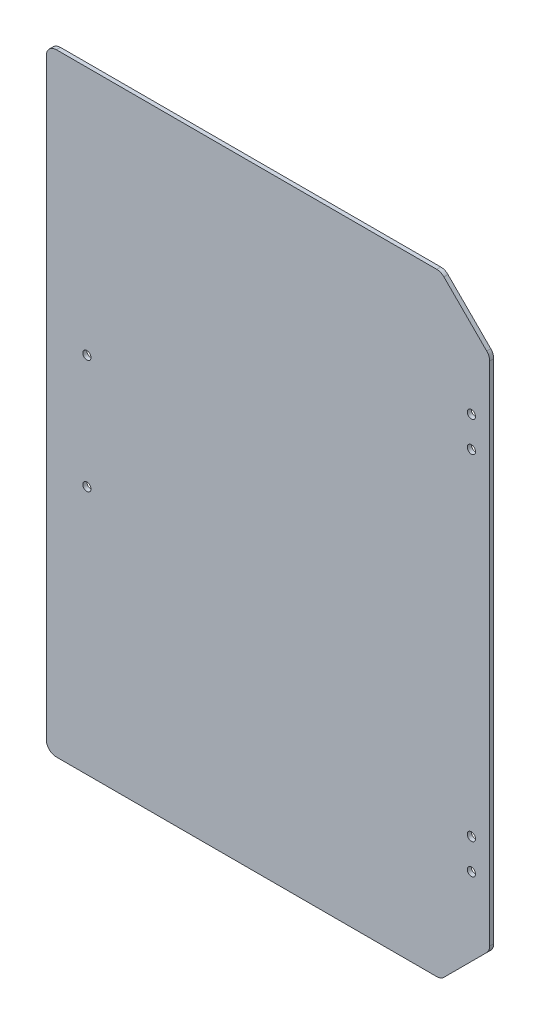
ISO-10303-21;
HEADER;
FILE_DESCRIPTION(('STEP AP214'),'2;1');
FILE_NAME('part.step','',(''),(''),'','','');
FILE_SCHEMA(('AUTOMOTIVE_DESIGN { 1 0 10303 214 1 1 1 1 }'));
ENDSEC;
DATA;
#1=APPLICATION_CONTEXT('core data for automotive mechanical design processes');
#2=APPLICATION_PROTOCOL_DEFINITION('international standard','automotive_design',2000,#1);
#3=PRODUCT_CONTEXT('',#1,'mechanical');
#4=PRODUCT('Part','Part','',(#3));
#5=PRODUCT_RELATED_PRODUCT_CATEGORY('part','',(#4));
#6=PRODUCT_DEFINITION_FORMATION('','',#4);
#7=PRODUCT_DEFINITION_CONTEXT('part definition',#1,'design');
#8=PRODUCT_DEFINITION('design','',#6,#7);
#9=PRODUCT_DEFINITION_SHAPE('','',#8);
#10=(LENGTH_UNIT() NAMED_UNIT(*) SI_UNIT(.MILLI.,.METRE.));
#11=(NAMED_UNIT(*) PLANE_ANGLE_UNIT() SI_UNIT($,.RADIAN.));
#12=(NAMED_UNIT(*) SI_UNIT($,.STERADIAN.) SOLID_ANGLE_UNIT());
#13=UNCERTAINTY_MEASURE_WITH_UNIT(LENGTH_MEASURE(1.E-05),#10,'distance_accuracy_value','');
#14=(GEOMETRIC_REPRESENTATION_CONTEXT(3) GLOBAL_UNCERTAINTY_ASSIGNED_CONTEXT((#13)) GLOBAL_UNIT_ASSIGNED_CONTEXT((#10,
#11,#12)) REPRESENTATION_CONTEXT('',''));
#15=CARTESIAN_POINT('',(0.,0.,0.));
#16=DIRECTION('',(0.,0.,1.));
#17=DIRECTION('',(1.,0.,0.));
#18=AXIS2_PLACEMENT_3D('',#15,#16,#17);
#19=CARTESIAN_POINT('',(0.,0.,4.));
#20=DIRECTION('',(0.,0.,-1.));
#21=DIRECTION('',(-1.,0.,0.));
#22=AXIS2_PLACEMENT_3D('',#19,#20,#21);
#23=PLANE('',#22);
#24=CARTESIAN_POINT('',(-198.144386368956,56.9354419410745,4.));
#25=DIRECTION('',(0.,0.,1.));
#26=DIRECTION('',(1.,0.,0.));
#27=AXIS2_PLACEMENT_3D('',#24,#25,#26);
#28=CIRCLE('',#27,4.04999999999999);
#29=CARTESIAN_POINT('',(-194.094386368956,56.9354419410745,4.));
#30=VERTEX_POINT('',#29);
#31=EDGE_CURVE('E263',#30,#30,#28,.T.);
#32=ORIENTED_EDGE('',*,*,#31,.F.);
#33=EDGE_LOOP('',(#32));
#34=FACE_BOUND('',#33,.T.);
#35=CARTESIAN_POINT('',(-198.144386368956,-55.0645580589255,4.));
#36=DIRECTION('',(0.,0.,1.));
#37=DIRECTION('',(1.,0.,0.));
#38=AXIS2_PLACEMENT_3D('',#35,#36,#37);
#39=CIRCLE('',#38,4.04999999999999);
#40=CARTESIAN_POINT('',(-194.094386368956,-55.0645580589255,4.));
#41=VERTEX_POINT('',#40);
#42=EDGE_CURVE('E257',#41,#41,#39,.T.);
#43=ORIENTED_EDGE('',*,*,#42,.F.);
#44=EDGE_LOOP('',(#43));
#45=FACE_BOUND('',#44,.T.);
#46=DIRECTION('',(-1.,0.,0.));
#47=VECTOR('',#46,1.);
#48=CARTESIAN_POINT('',(-238.144386368956,302.435441941074,4.));
#49=LINE('',#48,#47);
#50=CARTESIAN_POINT('',(146.213478007298,302.435441941074,4.));
#51=VERTEX_POINT('',#50);
#52=CARTESIAN_POINT('',(-228.144386368956,302.435441941074,4.));
#53=VERTEX_POINT('',#52);
#54=EDGE_CURVE('E160',#51,#53,#49,.T.);
#55=ORIENTED_EDGE('',*,*,#54,.T.);
#56=CARTESIAN_POINT('',(-228.144386368956,292.435441941074,4.));
#57=DIRECTION('',(0.,0.,-1.));
#58=DIRECTION('',(-1.,0.,0.));
#59=AXIS2_PLACEMENT_3D('',#56,#57,#58);
#60=CIRCLE('',#59,10.);
#61=CARTESIAN_POINT('',(-238.144386368956,292.435441941074,4.));
#62=VERTEX_POINT('',#61);
#63=EDGE_CURVE('E193',#53,#62,#60,.F.);
#64=ORIENTED_EDGE('',*,*,#63,.T.);
#65=DIRECTION('',(0.,-1.,0.));
#66=VECTOR('',#65,1.);
#67=CARTESIAN_POINT('',(-238.144386368956,-300.564558058925,4.));
#68=LINE('',#67,#66);
#69=CARTESIAN_POINT('',(-238.144386368956,-290.564558058925,4.));
#70=VERTEX_POINT('',#69);
#71=EDGE_CURVE('E143',#62,#70,#68,.T.);
#72=ORIENTED_EDGE('',*,*,#71,.T.);
#73=CARTESIAN_POINT('',(-228.144386368956,-290.564558058925,4.));
#74=DIRECTION('',(0.,0.,-1.));
#75=DIRECTION('',(-1.,0.,0.));
#76=AXIS2_PLACEMENT_3D('',#73,#74,#75);
#77=CIRCLE('',#76,10.);
#78=CARTESIAN_POINT('',(-228.144386368956,-300.564558058925,4.));
#79=VERTEX_POINT('',#78);
#80=EDGE_CURVE('E191',#70,#79,#77,.F.);
#81=ORIENTED_EDGE('',*,*,#80,.T.);
#82=DIRECTION('',(1.,0.,0.));
#83=VECTOR('',#82,1.);
#84=CARTESIAN_POINT('',(-238.144386368956,-300.564558058925,4.));
#85=LINE('',#84,#83);
#86=CARTESIAN_POINT('',(146.2134780073,-300.564558058925,4.));
#87=VERTEX_POINT('',#86);
#88=EDGE_CURVE('E232',#79,#87,#85,.T.);
#89=ORIENTED_EDGE('',*,*,#88,.T.);
#90=CARTESIAN_POINT('',(146.2134780073,-290.564558058925,4.));
#91=DIRECTION('',(0.,0.,-1.));
#92=DIRECTION('',(-1.,0.,0.));
#93=AXIS2_PLACEMENT_3D('',#90,#91,#92);
#94=CIRCLE('',#93,10.);
#95=CARTESIAN_POINT('',(153.284545819165,-297.635625870791,4.));
#96=VERTEX_POINT('',#95);
#97=EDGE_CURVE('E189',#87,#96,#94,.F.);
#98=ORIENTED_EDGE('',*,*,#97,.T.);
#99=DIRECTION('',(0.707106781186548,0.707106781186548,0.));
#100=VECTOR('',#99,1.);
#101=CARTESIAN_POINT('',(150.355613631031,-300.564558058925,4.));
#102=LINE('',#101,#100);
#103=CARTESIAN_POINT('',(195.426681442896,-255.49349024706,4.));
#104=VERTEX_POINT('',#103);
#105=EDGE_CURVE('E227',#96,#104,#102,.T.);
#106=ORIENTED_EDGE('',*,*,#105,.T.);
#107=CARTESIAN_POINT('',(188.355613631031,-248.422422435194,4.));
#108=DIRECTION('',(0.,0.,-1.));
#109=DIRECTION('',(-1.,0.,0.));
#110=AXIS2_PLACEMENT_3D('',#107,#108,#109);
#111=CIRCLE('',#110,10.);
#112=CARTESIAN_POINT('',(198.355613631031,-248.422422435194,4.));
#113=VERTEX_POINT('',#112);
#114=EDGE_CURVE('E187',#104,#113,#111,.F.);
#115=ORIENTED_EDGE('',*,*,#114,.T.);
#116=DIRECTION('',(0.,1.,0.));
#117=VECTOR('',#116,1.);
#118=CARTESIAN_POINT('',(198.355613631031,254.435441941074,4.));
#119=LINE('',#118,#117);
#120=CARTESIAN_POINT('',(198.355613631031,250.293306317343,4.));
#121=VERTEX_POINT('',#120);
#122=EDGE_CURVE('E215',#113,#121,#119,.T.);
#123=ORIENTED_EDGE('',*,*,#122,.T.);
#124=CARTESIAN_POINT('',(188.355613631031,250.293306317343,4.));
#125=DIRECTION('',(0.,0.,-1.));
#126=DIRECTION('',(-1.,0.,0.));
#127=AXIS2_PLACEMENT_3D('',#124,#125,#126);
#128=CIRCLE('',#127,10.);
#129=CARTESIAN_POINT('',(195.426681442896,257.364374129209,4.));
#130=VERTEX_POINT('',#129);
#131=EDGE_CURVE('E54',#121,#130,#128,.F.);
#132=ORIENTED_EDGE('',*,*,#131,.T.);
#133=DIRECTION('',(-0.707106781186557,0.707106781186539,0.));
#134=VECTOR('',#133,1.);
#135=CARTESIAN_POINT('',(150.355613631029,302.435441941074,4.));
#136=LINE('',#135,#134);
#137=CARTESIAN_POINT('',(153.284545819164,299.50650975294,4.));
#138=VERTEX_POINT('',#137);
#139=EDGE_CURVE('E224',#130,#138,#136,.T.);
#140=ORIENTED_EDGE('',*,*,#139,.T.);
#141=CARTESIAN_POINT('',(146.213478007298,292.435441941074,4.));
#142=DIRECTION('',(0.,0.,-1.));
#143=DIRECTION('',(-1.,0.,0.));
#144=AXIS2_PLACEMENT_3D('',#141,#142,#143);
#145=CIRCLE('',#144,10.);
#146=EDGE_CURVE('E184',#138,#51,#145,.F.);
#147=ORIENTED_EDGE('',*,*,#146,.T.);
#148=EDGE_LOOP('',(#55,#64,#72,#81,#89,#98,#106,#115,#123,#132,#140,#147));
#149=FACE_BOUND('',#148,.T.);
#150=CARTESIAN_POINT('',(180.355613631041,195.935441941075,4.));
#151=DIRECTION('',(0.,0.,1.));
#152=DIRECTION('',(1.,0.,0.));
#153=AXIS2_PLACEMENT_3D('',#150,#151,#152);
#154=CIRCLE('',#153,4.04999999999967);
#155=CARTESIAN_POINT('',(184.405613631041,195.935441941075,4.));
#156=VERTEX_POINT('',#155);
#157=EDGE_CURVE('E151',#156,#156,#154,.T.);
#158=ORIENTED_EDGE('',*,*,#157,.F.);
#159=EDGE_LOOP('',(#158));
#160=FACE_BOUND('',#159,.T.);
#161=CARTESIAN_POINT('',(180.355613631041,165.935441941075,4.));
#162=DIRECTION('',(0.,0.,1.));
#163=DIRECTION('',(1.,0.,0.));
#164=AXIS2_PLACEMENT_3D('',#161,#162,#163);
#165=CIRCLE('',#164,4.04999999999967);
#166=CARTESIAN_POINT('',(184.405613631041,165.935441941075,4.));
#167=VERTEX_POINT('',#166);
#168=EDGE_CURVE('E237',#167,#167,#165,.T.);
#169=ORIENTED_EDGE('',*,*,#168,.F.);
#170=EDGE_LOOP('',(#169));
#171=FACE_BOUND('',#170,.T.);
#172=CARTESIAN_POINT('',(180.355613631041,-164.064558058926,4.));
#173=DIRECTION('',(0.,0.,1.));
#174=DIRECTION('',(1.,0.,0.));
#175=AXIS2_PLACEMENT_3D('',#172,#173,#174);
#176=CIRCLE('',#175,4.04999999999967);
#177=CARTESIAN_POINT('',(184.405613631041,-164.064558058926,4.));
#178=VERTEX_POINT('',#177);
#179=EDGE_CURVE('E242',#178,#178,#176,.T.);
#180=ORIENTED_EDGE('',*,*,#179,.F.);
#181=EDGE_LOOP('',(#180));
#182=FACE_BOUND('',#181,.T.);
#183=CARTESIAN_POINT('',(180.355613631041,-194.064558058925,4.));
#184=DIRECTION('',(0.,0.,1.));
#185=DIRECTION('',(1.,0.,0.));
#186=AXIS2_PLACEMENT_3D('',#183,#184,#185);
#187=CIRCLE('',#186,4.04999999999967);
#188=CARTESIAN_POINT('',(184.405613631041,-194.064558058925,4.));
#189=VERTEX_POINT('',#188);
#190=EDGE_CURVE('E248',#189,#189,#187,.T.);
#191=ORIENTED_EDGE('',*,*,#190,.F.);
#192=EDGE_LOOP('',(#191));
#193=FACE_BOUND('',#192,.T.);
#194=ADVANCED_FACE('F33',(#34,#45,#149,#160,#171,#182,#193),#23,.F.);
#195=CARTESIAN_POINT('',(0.,0.,0.));
#196=DIRECTION('',(0.,0.,-1.));
#197=DIRECTION('',(-1.,0.,0.));
#198=AXIS2_PLACEMENT_3D('',#195,#196,#197);
#199=PLANE('',#198);
#200=CARTESIAN_POINT('',(-198.144386368956,56.9354419410745,0.));
#201=DIRECTION('',(0.,0.,1.));
#202=DIRECTION('',(1.,0.,0.));
#203=AXIS2_PLACEMENT_3D('',#200,#201,#202);
#204=CIRCLE('',#203,4.04999999999999);
#205=CARTESIAN_POINT('',(-194.094386368956,56.9354419410745,0.));
#206=VERTEX_POINT('',#205);
#207=EDGE_CURVE('E254',#206,#206,#204,.T.);
#208=ORIENTED_EDGE('',*,*,#207,.T.);
#209=EDGE_LOOP('',(#208));
#210=FACE_BOUND('',#209,.T.);
#211=CARTESIAN_POINT('',(-198.144386368956,-55.0645580589255,0.));
#212=DIRECTION('',(0.,0.,1.));
#213=DIRECTION('',(1.,0.,0.));
#214=AXIS2_PLACEMENT_3D('',#211,#212,#213);
#215=CIRCLE('',#214,4.04999999999999);
#216=CARTESIAN_POINT('',(-194.094386368956,-55.0645580589255,0.));
#217=VERTEX_POINT('',#216);
#218=EDGE_CURVE('E260',#217,#217,#215,.T.);
#219=ORIENTED_EDGE('',*,*,#218,.T.);
#220=EDGE_LOOP('',(#219));
#221=FACE_BOUND('',#220,.T.);
#222=CARTESIAN_POINT('',(180.355613631041,-164.064558058926,0.));
#223=DIRECTION('',(0.,0.,1.));
#224=DIRECTION('',(1.,0.,0.));
#225=AXIS2_PLACEMENT_3D('',#222,#223,#224);
#226=CIRCLE('',#225,4.04999999999967);
#227=CARTESIAN_POINT('',(184.405613631041,-164.064558058926,0.));
#228=VERTEX_POINT('',#227);
#229=EDGE_CURVE('E245',#228,#228,#226,.T.);
#230=ORIENTED_EDGE('',*,*,#229,.T.);
#231=EDGE_LOOP('',(#230));
#232=FACE_BOUND('',#231,.T.);
#233=CARTESIAN_POINT('',(180.355613631041,195.935441941075,0.));
#234=DIRECTION('',(0.,0.,1.));
#235=DIRECTION('',(1.,0.,0.));
#236=AXIS2_PLACEMENT_3D('',#233,#234,#235);
#237=CIRCLE('',#236,4.04999999999967);
#238=CARTESIAN_POINT('',(184.405613631041,195.935441941075,0.));
#239=VERTEX_POINT('',#238);
#240=EDGE_CURVE('E157',#239,#239,#237,.T.);
#241=ORIENTED_EDGE('',*,*,#240,.T.);
#242=EDGE_LOOP('',(#241));
#243=FACE_BOUND('',#242,.T.);
#244=DIRECTION('',(0.,-1.,0.));
#245=VECTOR('',#244,1.);
#246=CARTESIAN_POINT('',(-238.144386368956,-300.564558058925,0.));
#247=LINE('',#246,#245);
#248=CARTESIAN_POINT('',(-238.144386368956,292.435441941074,0.));
#249=VERTEX_POINT('',#248);
#250=CARTESIAN_POINT('',(-238.144386368956,-290.564558058925,0.));
#251=VERTEX_POINT('',#250);
#252=EDGE_CURVE('E140',#249,#251,#247,.T.);
#253=ORIENTED_EDGE('',*,*,#252,.F.);
#254=CARTESIAN_POINT('',(-228.144386368956,292.435441941074,0.));
#255=DIRECTION('',(0.,0.,-1.));
#256=DIRECTION('',(-1.,0.,0.));
#257=AXIS2_PLACEMENT_3D('',#254,#255,#256);
#258=CIRCLE('',#257,10.);
#259=CARTESIAN_POINT('',(-228.144386368956,302.435441941074,0.));
#260=VERTEX_POINT('',#259);
#261=EDGE_CURVE('E123',#249,#260,#258,.T.);
#262=ORIENTED_EDGE('',*,*,#261,.T.);
#263=DIRECTION('',(-1.,0.,0.));
#264=VECTOR('',#263,1.);
#265=CARTESIAN_POINT('',(-238.144386368956,302.435441941074,0.));
#266=LINE('',#265,#264);
#267=CARTESIAN_POINT('',(146.213478007298,302.435441941074,0.));
#268=VERTEX_POINT('',#267);
#269=EDGE_CURVE('E170',#268,#260,#266,.T.);
#270=ORIENTED_EDGE('',*,*,#269,.F.);
#271=CARTESIAN_POINT('',(146.213478007298,292.435441941074,0.));
#272=DIRECTION('',(0.,0.,-1.));
#273=DIRECTION('',(-1.,0.,0.));
#274=AXIS2_PLACEMENT_3D('',#271,#272,#273);
#275=CIRCLE('',#274,10.);
#276=CARTESIAN_POINT('',(153.284545819164,299.50650975294,0.));
#277=VERTEX_POINT('',#276);
#278=EDGE_CURVE('E144',#268,#277,#275,.T.);
#279=ORIENTED_EDGE('',*,*,#278,.T.);
#280=DIRECTION('',(-0.707106781186557,0.707106781186539,0.));
#281=VECTOR('',#280,1.);
#282=CARTESIAN_POINT('',(150.355613631029,302.435441941074,0.));
#283=LINE('',#282,#281);
#284=CARTESIAN_POINT('',(195.426681442896,257.364374129209,0.));
#285=VERTEX_POINT('',#284);
#286=EDGE_CURVE('E168',#285,#277,#283,.T.);
#287=ORIENTED_EDGE('',*,*,#286,.F.);
#288=CARTESIAN_POINT('',(188.355613631031,250.293306317343,0.));
#289=DIRECTION('',(0.,0.,-1.));
#290=DIRECTION('',(-1.,0.,0.));
#291=AXIS2_PLACEMENT_3D('',#288,#289,#290);
#292=CIRCLE('',#291,10.);
#293=CARTESIAN_POINT('',(198.355613631031,250.293306317343,0.));
#294=VERTEX_POINT('',#293);
#295=EDGE_CURVE('E174',#285,#294,#292,.T.);
#296=ORIENTED_EDGE('',*,*,#295,.T.);
#297=DIRECTION('',(0.,1.,0.));
#298=VECTOR('',#297,1.);
#299=CARTESIAN_POINT('',(198.355613631031,254.435441941074,0.));
#300=LINE('',#299,#298);
#301=CARTESIAN_POINT('',(198.355613631031,-248.422422435194,0.));
#302=VERTEX_POINT('',#301);
#303=EDGE_CURVE('E165',#302,#294,#300,.T.);
#304=ORIENTED_EDGE('',*,*,#303,.F.);
#305=CARTESIAN_POINT('',(188.355613631031,-248.422422435194,0.));
#306=DIRECTION('',(0.,0.,-1.));
#307=DIRECTION('',(-1.,0.,0.));
#308=AXIS2_PLACEMENT_3D('',#305,#306,#307);
#309=CIRCLE('',#308,10.);
#310=CARTESIAN_POINT('',(195.426681442896,-255.49349024706,0.));
#311=VERTEX_POINT('',#310);
#312=EDGE_CURVE('E176',#302,#311,#309,.T.);
#313=ORIENTED_EDGE('',*,*,#312,.T.);
#314=DIRECTION('',(0.707106781186548,0.707106781186548,0.));
#315=VECTOR('',#314,1.);
#316=CARTESIAN_POINT('',(150.355613631031,-300.564558058925,0.));
#317=LINE('',#316,#315);
#318=CARTESIAN_POINT('',(153.284545819165,-297.635625870791,0.));
#319=VERTEX_POINT('',#318);
#320=EDGE_CURVE('E154',#319,#311,#317,.T.);
#321=ORIENTED_EDGE('',*,*,#320,.F.);
#322=CARTESIAN_POINT('',(146.2134780073,-290.564558058925,0.));
#323=DIRECTION('',(0.,0.,-1.));
#324=DIRECTION('',(-1.,0.,0.));
#325=AXIS2_PLACEMENT_3D('',#322,#323,#324);
#326=CIRCLE('',#325,10.);
#327=CARTESIAN_POINT('',(146.2134780073,-300.564558058925,0.));
#328=VERTEX_POINT('',#327);
#329=EDGE_CURVE('E178',#319,#328,#326,.T.);
#330=ORIENTED_EDGE('',*,*,#329,.T.);
#331=DIRECTION('',(1.,0.,0.));
#332=VECTOR('',#331,1.);
#333=CARTESIAN_POINT('',(-238.144386368956,-300.564558058925,0.));
#334=LINE('',#333,#332);
#335=CARTESIAN_POINT('',(-228.144386368956,-300.564558058925,0.));
#336=VERTEX_POINT('',#335);
#337=EDGE_CURVE('E150',#336,#328,#334,.T.);
#338=ORIENTED_EDGE('',*,*,#337,.F.);
#339=CARTESIAN_POINT('',(-228.144386368956,-290.564558058925,0.));
#340=DIRECTION('',(0.,0.,-1.));
#341=DIRECTION('',(-1.,0.,0.));
#342=AXIS2_PLACEMENT_3D('',#339,#340,#341);
#343=CIRCLE('',#342,10.);
#344=EDGE_CURVE('E134',#336,#251,#343,.T.);
#345=ORIENTED_EDGE('',*,*,#344,.T.);
#346=EDGE_LOOP('',(#253,#262,#270,#279,#287,#296,#304,#313,#321,#330,#338,#345));
#347=FACE_BOUND('',#346,.T.);
#348=CARTESIAN_POINT('',(180.355613631041,165.935441941075,0.));
#349=DIRECTION('',(0.,0.,1.));
#350=DIRECTION('',(1.,0.,0.));
#351=AXIS2_PLACEMENT_3D('',#348,#349,#350);
#352=CIRCLE('',#351,4.04999999999967);
#353=CARTESIAN_POINT('',(184.405613631041,165.935441941075,0.));
#354=VERTEX_POINT('',#353);
#355=EDGE_CURVE('E239',#354,#354,#352,.T.);
#356=ORIENTED_EDGE('',*,*,#355,.T.);
#357=EDGE_LOOP('',(#356));
#358=FACE_BOUND('',#357,.T.);
#359=CARTESIAN_POINT('',(180.355613631041,-194.064558058925,0.));
#360=DIRECTION('',(0.,0.,1.));
#361=DIRECTION('',(1.,0.,0.));
#362=AXIS2_PLACEMENT_3D('',#359,#360,#361);
#363=CIRCLE('',#362,4.04999999999967);
#364=CARTESIAN_POINT('',(184.405613631041,-194.064558058925,0.));
#365=VERTEX_POINT('',#364);
#366=EDGE_CURVE('E251',#365,#365,#363,.T.);
#367=ORIENTED_EDGE('',*,*,#366,.T.);
#368=EDGE_LOOP('',(#367));
#369=FACE_BOUND('',#368,.T.);
#370=ADVANCED_FACE('F147',(#210,#221,#232,#243,#347,#358,#369),#199,.T.);
#371=CARTESIAN_POINT('',(-238.144386368956,-300.564558058925,4.));
#372=DIRECTION('',(1.,0.,0.));
#373=DIRECTION('',(0.,0.,-1.));
#374=AXIS2_PLACEMENT_3D('',#371,#372,#373);
#375=PLANE('',#374);
#376=ORIENTED_EDGE('',*,*,#71,.F.);
#377=DIRECTION('',(0.,0.,-1.));
#378=VECTOR('',#377,1.);
#379=CARTESIAN_POINT('',(-238.144386368956,292.435441941074,4.));
#380=LINE('',#379,#378);
#381=EDGE_CURVE('E127',#62,#249,#380,.T.);
#382=ORIENTED_EDGE('',*,*,#381,.T.);
#383=ORIENTED_EDGE('',*,*,#252,.T.);
#384=DIRECTION('',(0.,0.,-1.));
#385=VECTOR('',#384,1.);
#386=CARTESIAN_POINT('',(-238.144386368956,-290.564558058925,4.));
#387=LINE('',#386,#385);
#388=EDGE_CURVE('E145',#251,#70,#387,.F.);
#389=ORIENTED_EDGE('',*,*,#388,.T.);
#390=EDGE_LOOP('',(#376,#382,#383,#389));
#391=FACE_BOUND('',#390,.T.);
#392=ADVANCED_FACE('F139',(#391),#375,.F.);
#393=CARTESIAN_POINT('',(-238.144386368956,-300.564558058925,4.));
#394=DIRECTION('',(0.,1.,0.));
#395=DIRECTION('',(-1.,0.,0.));
#396=AXIS2_PLACEMENT_3D('',#393,#394,#395);
#397=PLANE('',#396);
#398=ORIENTED_EDGE('',*,*,#88,.F.);
#399=DIRECTION('',(0.,0.,-1.));
#400=VECTOR('',#399,1.);
#401=CARTESIAN_POINT('',(-228.144386368956,-300.564558058925,4.));
#402=LINE('',#401,#400);
#403=EDGE_CURVE('E197',#79,#336,#402,.T.);
#404=ORIENTED_EDGE('',*,*,#403,.T.);
#405=ORIENTED_EDGE('',*,*,#337,.T.);
#406=DIRECTION('',(0.,0.,-1.));
#407=VECTOR('',#406,1.);
#408=CARTESIAN_POINT('',(146.2134780073,-300.564558058925,4.));
#409=LINE('',#408,#407);
#410=EDGE_CURVE('E195',#328,#87,#409,.F.);
#411=ORIENTED_EDGE('',*,*,#410,.T.);
#412=EDGE_LOOP('',(#398,#404,#405,#411));
#413=FACE_BOUND('',#412,.T.);
#414=ADVANCED_FACE('F304',(#413),#397,.F.);
#415=CARTESIAN_POINT('',(150.355613631031,-300.564558058925,4.));
#416=DIRECTION('',(-0.707106781186547,0.707106781186547,0.));
#417=DIRECTION('',(-0.707106781186548,-0.707106781186548,0.));
#418=AXIS2_PLACEMENT_3D('',#415,#416,#417);
#419=PLANE('',#418);
#420=ORIENTED_EDGE('',*,*,#105,.F.);
#421=DIRECTION('',(0.,0.,-1.));
#422=VECTOR('',#421,1.);
#423=CARTESIAN_POINT('',(153.284545819165,-297.635625870791,4.));
#424=LINE('',#423,#422);
#425=EDGE_CURVE('E202',#96,#319,#424,.T.);
#426=ORIENTED_EDGE('',*,*,#425,.T.);
#427=ORIENTED_EDGE('',*,*,#320,.T.);
#428=DIRECTION('',(0.,0.,-1.));
#429=VECTOR('',#428,1.);
#430=CARTESIAN_POINT('',(195.426681442896,-255.49349024706,4.));
#431=LINE('',#430,#429);
#432=EDGE_CURVE('E200',#311,#104,#431,.F.);
#433=ORIENTED_EDGE('',*,*,#432,.T.);
#434=EDGE_LOOP('',(#420,#426,#427,#433));
#435=FACE_BOUND('',#434,.T.);
#436=ADVANCED_FACE('F317',(#435),#419,.F.);
#437=CARTESIAN_POINT('',(198.355613631031,254.435441941074,4.));
#438=DIRECTION('',(-1.,0.,0.));
#439=DIRECTION('',(0.,0.,1.));
#440=AXIS2_PLACEMENT_3D('',#437,#438,#439);
#441=PLANE('',#440);
#442=ORIENTED_EDGE('',*,*,#122,.F.);
#443=DIRECTION('',(0.,0.,-1.));
#444=VECTOR('',#443,1.);
#445=CARTESIAN_POINT('',(198.355613631031,-248.422422435194,4.));
#446=LINE('',#445,#444);
#447=EDGE_CURVE('E207',#113,#302,#446,.T.);
#448=ORIENTED_EDGE('',*,*,#447,.T.);
#449=ORIENTED_EDGE('',*,*,#303,.T.);
#450=DIRECTION('',(0.,0.,-1.));
#451=VECTOR('',#450,1.);
#452=CARTESIAN_POINT('',(198.355613631031,250.293306317343,4.));
#453=LINE('',#452,#451);
#454=EDGE_CURVE('E205',#294,#121,#453,.F.);
#455=ORIENTED_EDGE('',*,*,#454,.T.);
#456=EDGE_LOOP('',(#442,#448,#449,#455));
#457=FACE_BOUND('',#456,.T.);
#458=ADVANCED_FACE('F213',(#457),#441,.F.);
#459=CARTESIAN_POINT('',(150.355613631029,302.435441941074,4.));
#460=DIRECTION('',(-0.707106781186539,-0.707106781186557,0.));
#461=DIRECTION('',(0.707106781186557,-0.707106781186539,0.));
#462=AXIS2_PLACEMENT_3D('',#459,#460,#461);
#463=PLANE('',#462);
#464=ORIENTED_EDGE('',*,*,#139,.F.);
#465=DIRECTION('',(0.,0.,-1.));
#466=VECTOR('',#465,1.);
#467=CARTESIAN_POINT('',(195.426681442896,257.364374129209,4.));
#468=LINE('',#467,#466);
#469=EDGE_CURVE('E11',#130,#285,#468,.T.);
#470=ORIENTED_EDGE('',*,*,#469,.T.);
#471=ORIENTED_EDGE('',*,*,#286,.T.);
#472=DIRECTION('',(0.,0.,-1.));
#473=VECTOR('',#472,1.);
#474=CARTESIAN_POINT('',(153.284545819164,299.50650975294,4.));
#475=LINE('',#474,#473);
#476=EDGE_CURVE('E41',#277,#138,#475,.F.);
#477=ORIENTED_EDGE('',*,*,#476,.T.);
#478=EDGE_LOOP('',(#464,#470,#471,#477));
#479=FACE_BOUND('',#478,.T.);
#480=ADVANCED_FACE('F223',(#479),#463,.F.);
#481=CARTESIAN_POINT('',(-238.144386368956,302.435441941074,4.));
#482=DIRECTION('',(0.,-1.,0.));
#483=DIRECTION('',(1.,0.,0.));
#484=AXIS2_PLACEMENT_3D('',#481,#482,#483);
#485=PLANE('',#484);
#486=ORIENTED_EDGE('',*,*,#269,.T.);
#487=DIRECTION('',(0.,0.,-1.));
#488=VECTOR('',#487,1.);
#489=CARTESIAN_POINT('',(-228.144386368956,302.435441941074,4.));
#490=LINE('',#489,#488);
#491=EDGE_CURVE('E128',#260,#53,#490,.F.);
#492=ORIENTED_EDGE('',*,*,#491,.T.);
#493=ORIENTED_EDGE('',*,*,#54,.F.);
#494=DIRECTION('',(0.,0.,-1.));
#495=VECTOR('',#494,1.);
#496=CARTESIAN_POINT('',(146.213478007298,302.435441941074,4.));
#497=LINE('',#496,#495);
#498=EDGE_CURVE('E133',#51,#268,#497,.T.);
#499=ORIENTED_EDGE('',*,*,#498,.T.);
#500=EDGE_LOOP('',(#486,#492,#493,#499));
#501=FACE_BOUND('',#500,.T.);
#502=ADVANCED_FACE('F308',(#501),#485,.F.);
#503=CARTESIAN_POINT('',(180.355613631041,195.935441941075,4.));
#504=DIRECTION('',(0.,0.,-1.));
#505=DIRECTION('',(-1.,0.,0.));
#506=AXIS2_PLACEMENT_3D('',#503,#504,#505);
#507=CYLINDRICAL_SURFACE('',#506,4.04999999999967);
#508=ORIENTED_EDGE('',*,*,#157,.T.);
#509=EDGE_LOOP('',(#508));
#510=FACE_BOUND('',#509,.T.);
#511=ORIENTED_EDGE('',*,*,#240,.F.);
#512=EDGE_LOOP('',(#511));
#513=FACE_BOUND('',#512,.T.);
#514=ADVANCED_FACE('F311',(#510,#513),#507,.F.);
#515=CARTESIAN_POINT('',(180.355613631041,165.935441941075,4.));
#516=DIRECTION('',(0.,0.,-1.));
#517=DIRECTION('',(-1.,0.,0.));
#518=AXIS2_PLACEMENT_3D('',#515,#516,#517);
#519=CYLINDRICAL_SURFACE('',#518,4.04999999999967);
#520=ORIENTED_EDGE('',*,*,#168,.T.);
#521=EDGE_LOOP('',(#520));
#522=FACE_BOUND('',#521,.T.);
#523=ORIENTED_EDGE('',*,*,#355,.F.);
#524=EDGE_LOOP('',(#523));
#525=FACE_BOUND('',#524,.T.);
#526=ADVANCED_FACE('F354',(#522,#525),#519,.F.);
#527=CARTESIAN_POINT('',(180.355613631041,-164.064558058926,4.));
#528=DIRECTION('',(0.,0.,-1.));
#529=DIRECTION('',(-1.,0.,0.));
#530=AXIS2_PLACEMENT_3D('',#527,#528,#529);
#531=CYLINDRICAL_SURFACE('',#530,4.04999999999967);
#532=ORIENTED_EDGE('',*,*,#179,.T.);
#533=EDGE_LOOP('',(#532));
#534=FACE_BOUND('',#533,.T.);
#535=ORIENTED_EDGE('',*,*,#229,.F.);
#536=EDGE_LOOP('',(#535));
#537=FACE_BOUND('',#536,.T.);
#538=ADVANCED_FACE('F295',(#534,#537),#531,.F.);
#539=CARTESIAN_POINT('',(180.355613631041,-194.064558058925,4.));
#540=DIRECTION('',(0.,0.,-1.));
#541=DIRECTION('',(-1.,0.,0.));
#542=AXIS2_PLACEMENT_3D('',#539,#540,#541);
#543=CYLINDRICAL_SURFACE('',#542,4.04999999999967);
#544=ORIENTED_EDGE('',*,*,#190,.T.);
#545=EDGE_LOOP('',(#544));
#546=FACE_BOUND('',#545,.T.);
#547=ORIENTED_EDGE('',*,*,#366,.F.);
#548=EDGE_LOOP('',(#547));
#549=FACE_BOUND('',#548,.T.);
#550=ADVANCED_FACE('F292',(#546,#549),#543,.F.);
#551=CARTESIAN_POINT('',(-228.144386368956,292.435441941074,4.));
#552=DIRECTION('',(0.,0.,-1.));
#553=DIRECTION('',(-1.,0.,0.));
#554=AXIS2_PLACEMENT_3D('',#551,#552,#553);
#555=CYLINDRICAL_SURFACE('',#554,10.);
#556=ORIENTED_EDGE('',*,*,#63,.F.);
#557=ORIENTED_EDGE('',*,*,#491,.F.);
#558=ORIENTED_EDGE('',*,*,#261,.F.);
#559=ORIENTED_EDGE('',*,*,#381,.F.);
#560=EDGE_LOOP('',(#556,#557,#558,#559));
#561=FACE_BOUND('',#560,.T.);
#562=ADVANCED_FACE('F126',(#561),#555,.T.);
#563=CARTESIAN_POINT('',(-228.144386368956,-290.564558058925,4.));
#564=DIRECTION('',(0.,0.,-1.));
#565=DIRECTION('',(-1.,0.,0.));
#566=AXIS2_PLACEMENT_3D('',#563,#564,#565);
#567=CYLINDRICAL_SURFACE('',#566,10.);
#568=ORIENTED_EDGE('',*,*,#80,.F.);
#569=ORIENTED_EDGE('',*,*,#388,.F.);
#570=ORIENTED_EDGE('',*,*,#344,.F.);
#571=ORIENTED_EDGE('',*,*,#403,.F.);
#572=EDGE_LOOP('',(#568,#569,#570,#571));
#573=FACE_BOUND('',#572,.T.);
#574=ADVANCED_FACE('F326',(#573),#567,.T.);
#575=CARTESIAN_POINT('',(146.2134780073,-290.564558058925,4.));
#576=DIRECTION('',(0.,0.,-1.));
#577=DIRECTION('',(-1.,0.,0.));
#578=AXIS2_PLACEMENT_3D('',#575,#576,#577);
#579=CYLINDRICAL_SURFACE('',#578,10.);
#580=ORIENTED_EDGE('',*,*,#97,.F.);
#581=ORIENTED_EDGE('',*,*,#410,.F.);
#582=ORIENTED_EDGE('',*,*,#329,.F.);
#583=ORIENTED_EDGE('',*,*,#425,.F.);
#584=EDGE_LOOP('',(#580,#581,#582,#583));
#585=FACE_BOUND('',#584,.T.);
#586=ADVANCED_FACE('F329',(#585),#579,.T.);
#587=CARTESIAN_POINT('',(188.355613631031,-248.422422435194,4.));
#588=DIRECTION('',(0.,0.,-1.));
#589=DIRECTION('',(-1.,0.,0.));
#590=AXIS2_PLACEMENT_3D('',#587,#588,#589);
#591=CYLINDRICAL_SURFACE('',#590,10.);
#592=ORIENTED_EDGE('',*,*,#114,.F.);
#593=ORIENTED_EDGE('',*,*,#432,.F.);
#594=ORIENTED_EDGE('',*,*,#312,.F.);
#595=ORIENTED_EDGE('',*,*,#447,.F.);
#596=EDGE_LOOP('',(#592,#593,#594,#595));
#597=FACE_BOUND('',#596,.T.);
#598=ADVANCED_FACE('F333',(#597),#591,.T.);
#599=CARTESIAN_POINT('',(188.355613631031,250.293306317343,4.));
#600=DIRECTION('',(0.,0.,-1.));
#601=DIRECTION('',(-1.,0.,0.));
#602=AXIS2_PLACEMENT_3D('',#599,#600,#601);
#603=CYLINDRICAL_SURFACE('',#602,10.);
#604=ORIENTED_EDGE('',*,*,#131,.F.);
#605=ORIENTED_EDGE('',*,*,#454,.F.);
#606=ORIENTED_EDGE('',*,*,#295,.F.);
#607=ORIENTED_EDGE('',*,*,#469,.F.);
#608=EDGE_LOOP('',(#604,#605,#606,#607));
#609=FACE_BOUND('',#608,.T.);
#610=ADVANCED_FACE('F222',(#609),#603,.T.);
#611=CARTESIAN_POINT('',(146.213478007298,292.435441941074,4.));
#612=DIRECTION('',(0.,0.,-1.));
#613=DIRECTION('',(-1.,0.,0.));
#614=AXIS2_PLACEMENT_3D('',#611,#612,#613);
#615=CYLINDRICAL_SURFACE('',#614,10.);
#616=ORIENTED_EDGE('',*,*,#146,.F.);
#617=ORIENTED_EDGE('',*,*,#476,.F.);
#618=ORIENTED_EDGE('',*,*,#278,.F.);
#619=ORIENTED_EDGE('',*,*,#498,.F.);
#620=EDGE_LOOP('',(#616,#617,#618,#619));
#621=FACE_BOUND('',#620,.T.);
#622=ADVANCED_FACE('F35',(#621),#615,.T.);
#623=CARTESIAN_POINT('',(-198.144386368956,-55.0645580589255,0.));
#624=DIRECTION('',(0.,0.,1.));
#625=DIRECTION('',(1.,0.,0.));
#626=AXIS2_PLACEMENT_3D('',#623,#624,#625);
#627=CYLINDRICAL_SURFACE('',#626,4.04999999999999);
#628=ORIENTED_EDGE('',*,*,#218,.F.);
#629=EDGE_LOOP('',(#628));
#630=FACE_BOUND('',#629,.T.);
#631=ORIENTED_EDGE('',*,*,#42,.T.);
#632=EDGE_LOOP('',(#631));
#633=FACE_BOUND('',#632,.T.);
#634=ADVANCED_FACE('F274',(#630,#633),#627,.F.);
#635=CARTESIAN_POINT('',(-198.144386368956,56.9354419410745,0.));
#636=DIRECTION('',(0.,0.,1.));
#637=DIRECTION('',(1.,0.,0.));
#638=AXIS2_PLACEMENT_3D('',#635,#636,#637);
#639=CYLINDRICAL_SURFACE('',#638,4.04999999999999);
#640=ORIENTED_EDGE('',*,*,#207,.F.);
#641=EDGE_LOOP('',(#640));
#642=FACE_BOUND('',#641,.T.);
#643=ORIENTED_EDGE('',*,*,#31,.T.);
#644=EDGE_LOOP('',(#643));
#645=FACE_BOUND('',#644,.T.);
#646=ADVANCED_FACE('F271',(#642,#645),#639,.F.);
#647=CLOSED_SHELL('',(#194,#370,#392,#414,#436,#458,#480,#502,#514,#526,#538,#550,#562,#574,
#586,#598,#610,#622,#634,#646));
#648=MANIFOLD_SOLID_BREP('B2',#647);
#649=ADVANCED_BREP_SHAPE_REPRESENTATION('',(#18,#648),#14);
#650=SHAPE_DEFINITION_REPRESENTATION(#9,#649);
ENDSEC;
END-ISO-10303-21;
